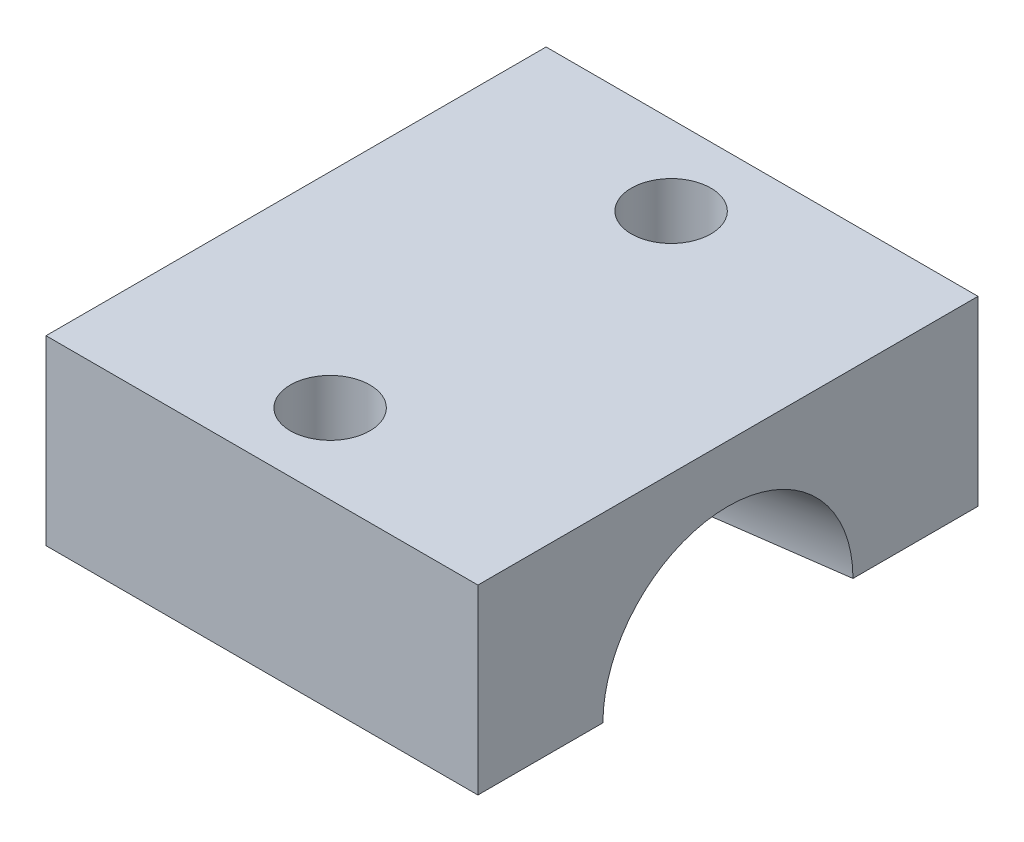
ISO-10303-21;
HEADER;
FILE_DESCRIPTION(('STEP AP214'),'2;1');
FILE_NAME('part.step','',(''),(''),'','','');
FILE_SCHEMA(('AUTOMOTIVE_DESIGN { 1 0 10303 214 1 1 1 1 }'));
ENDSEC;
DATA;
#1=APPLICATION_CONTEXT('core data for automotive mechanical design processes');
#2=APPLICATION_PROTOCOL_DEFINITION('international standard','automotive_design',2000,#1);
#3=PRODUCT_CONTEXT('',#1,'mechanical');
#4=PRODUCT('Part','Part','',(#3));
#5=PRODUCT_RELATED_PRODUCT_CATEGORY('part','',(#4));
#6=PRODUCT_DEFINITION_FORMATION('','',#4);
#7=PRODUCT_DEFINITION_CONTEXT('part definition',#1,'design');
#8=PRODUCT_DEFINITION('design','',#6,#7);
#9=PRODUCT_DEFINITION_SHAPE('','',#8);
#10=(LENGTH_UNIT() NAMED_UNIT(*) SI_UNIT(.MILLI.,.METRE.));
#11=(NAMED_UNIT(*) PLANE_ANGLE_UNIT() SI_UNIT($,.RADIAN.));
#12=(NAMED_UNIT(*) SI_UNIT($,.STERADIAN.) SOLID_ANGLE_UNIT());
#13=UNCERTAINTY_MEASURE_WITH_UNIT(LENGTH_MEASURE(1.E-05),#10,'distance_accuracy_value','');
#14=(GEOMETRIC_REPRESENTATION_CONTEXT(3) GLOBAL_UNCERTAINTY_ASSIGNED_CONTEXT((#13)) GLOBAL_UNIT_ASSIGNED_CONTEXT((#10,
#11,#12)) REPRESENTATION_CONTEXT('',''));
#15=CARTESIAN_POINT('',(0.,0.,0.));
#16=DIRECTION('',(0.,0.,1.));
#17=DIRECTION('',(1.,0.,0.));
#18=AXIS2_PLACEMENT_3D('',#15,#16,#17);
#19=CARTESIAN_POINT('',(0.,-4.,0.));
#20=DIRECTION('',(0.,-1.,0.));
#21=DIRECTION('',(0.,0.,-1.));
#22=AXIS2_PLACEMENT_3D('',#19,#20,#21);
#23=PLANE('',#22);
#24=DIRECTION('',(0.990621129243475,0.,-0.136637397137031));
#25=VECTOR('',#24,1.);
#26=CARTESIAN_POINT('',(-31.375,-4.,0.));
#27=LINE('',#26,#25);
#28=CARTESIAN_POINT('',(-6.,-4.,-3.5));
#29=VERTEX_POINT('',#28);
#30=CARTESIAN_POINT('',(8.5,-4.,-5.5));
#31=VERTEX_POINT('',#30);
#32=EDGE_CURVE('E174',#29,#31,#27,.T.);
#33=ORIENTED_EDGE('',*,*,#32,.F.);
#34=DIRECTION('',(-1.,0.,0.));
#35=VECTOR('',#34,1.);
#36=CARTESIAN_POINT('',(-6.,-4.,-3.5));
#37=LINE('',#36,#35);
#38=CARTESIAN_POINT('',(-10.5,-4.,-3.5));
#39=VERTEX_POINT('',#38);
#40=EDGE_CURVE('E116',#39,#29,#37,.F.);
#41=ORIENTED_EDGE('',*,*,#40,.F.);
#42=DIRECTION('',(0.,0.,1.));
#43=VECTOR('',#42,1.);
#44=CARTESIAN_POINT('',(-10.5,-4.,-11.));
#45=LINE('',#44,#43);
#46=CARTESIAN_POINT('',(-10.5,-4.,-11.));
#47=VERTEX_POINT('',#46);
#48=EDGE_CURVE('E112',#47,#39,#45,.T.);
#49=ORIENTED_EDGE('',*,*,#48,.F.);
#50=DIRECTION('',(-1.,0.,0.));
#51=VECTOR('',#50,1.);
#52=CARTESIAN_POINT('',(-8.5,-4.,-11.));
#53=LINE('',#52,#51);
#54=CARTESIAN_POINT('',(8.5,-4.,-11.));
#55=VERTEX_POINT('',#54);
#56=EDGE_CURVE('E102',#55,#47,#53,.T.);
#57=ORIENTED_EDGE('',*,*,#56,.F.);
#58=DIRECTION('',(0.,0.,-1.));
#59=VECTOR('',#58,1.);
#60=CARTESIAN_POINT('',(8.5,-4.,11.));
#61=LINE('',#60,#59);
#62=EDGE_CURVE('E66',#31,#55,#61,.T.);
#63=ORIENTED_EDGE('',*,*,#62,.F.);
#64=EDGE_LOOP('',(#33,#41,#49,#57,#63));
#65=FACE_BOUND('',#64,.T.);
#66=CARTESIAN_POINT('',(-1.5,-4.,-7.5));
#67=DIRECTION('',(0.,1.,0.));
#68=DIRECTION('',(0.,0.,1.));
#69=AXIS2_PLACEMENT_3D('',#66,#67,#68);
#70=CIRCLE('',#69,1.75);
#71=CARTESIAN_POINT('',(-1.5,-4.,-5.75));
#72=VERTEX_POINT('',#71);
#73=EDGE_CURVE('E183',#72,#72,#70,.T.);
#74=ORIENTED_EDGE('',*,*,#73,.T.);
#75=EDGE_LOOP('',(#74));
#76=FACE_BOUND('',#75,.T.);
#77=ADVANCED_FACE('F35',(#65,#76),#23,.T.);
#78=CARTESIAN_POINT('',(0.,4.,0.));
#79=DIRECTION('',(0.,-1.,0.));
#80=DIRECTION('',(0.,0.,-1.));
#81=AXIS2_PLACEMENT_3D('',#78,#79,#80);
#82=PLANE('',#81);
#83=DIRECTION('',(0.,0.,-1.));
#84=VECTOR('',#83,1.);
#85=CARTESIAN_POINT('',(8.5,4.,11.));
#86=LINE('',#85,#84);
#87=CARTESIAN_POINT('',(8.5,4.,11.));
#88=VERTEX_POINT('',#87);
#89=CARTESIAN_POINT('',(8.5,4.,-11.));
#90=VERTEX_POINT('',#89);
#91=EDGE_CURVE('E192',#88,#90,#86,.T.);
#92=ORIENTED_EDGE('',*,*,#91,.T.);
#93=DIRECTION('',(-1.,0.,0.));
#94=VECTOR('',#93,1.);
#95=CARTESIAN_POINT('',(-8.5,4.,-11.));
#96=LINE('',#95,#94);
#97=CARTESIAN_POINT('',(-10.5,4.,-11.));
#98=VERTEX_POINT('',#97);
#99=EDGE_CURVE('E194',#90,#98,#96,.T.);
#100=ORIENTED_EDGE('',*,*,#99,.T.);
#101=DIRECTION('',(0.,0.,-1.));
#102=VECTOR('',#101,1.);
#103=CARTESIAN_POINT('',(-10.5,4.,-11.));
#104=LINE('',#103,#102);
#105=CARTESIAN_POINT('',(-10.5,4.,11.));
#106=VERTEX_POINT('',#105);
#107=EDGE_CURVE('E125',#106,#98,#104,.T.);
#108=ORIENTED_EDGE('',*,*,#107,.F.);
#109=DIRECTION('',(1.,0.,0.));
#110=VECTOR('',#109,1.);
#111=CARTESIAN_POINT('',(-8.5,4.,11.));
#112=LINE('',#111,#110);
#113=EDGE_CURVE('E54',#106,#88,#112,.T.);
#114=ORIENTED_EDGE('',*,*,#113,.T.);
#115=EDGE_LOOP('',(#92,#100,#108,#114));
#116=FACE_BOUND('',#115,.T.);
#117=CARTESIAN_POINT('',(-1.5,4.,-7.5));
#118=DIRECTION('',(0.,1.,0.));
#119=DIRECTION('',(0.,0.,1.));
#120=AXIS2_PLACEMENT_3D('',#117,#118,#119);
#121=CIRCLE('',#120,1.75);
#122=CARTESIAN_POINT('',(-1.5,4.,-5.75));
#123=VERTEX_POINT('',#122);
#124=EDGE_CURVE('E187',#123,#123,#121,.T.);
#125=ORIENTED_EDGE('',*,*,#124,.F.);
#126=EDGE_LOOP('',(#125));
#127=FACE_BOUND('',#126,.T.);
#128=CARTESIAN_POINT('',(-1.5,4.,7.5));
#129=DIRECTION('',(0.,1.,0.));
#130=DIRECTION('',(0.,0.,1.));
#131=AXIS2_PLACEMENT_3D('',#128,#129,#130);
#132=CIRCLE('',#131,1.75);
#133=CARTESIAN_POINT('',(-1.5,4.,9.25));
#134=VERTEX_POINT('',#133);
#135=EDGE_CURVE('E180',#134,#134,#132,.T.);
#136=ORIENTED_EDGE('',*,*,#135,.F.);
#137=EDGE_LOOP('',(#136));
#138=FACE_BOUND('',#137,.T.);
#139=ADVANCED_FACE('F217',(#116,#127,#138),#82,.F.);
#140=DIRECTION('',(-0.990621129243475,0.,-0.136637397137031));
#141=VECTOR('',#140,1.);
#142=CARTESIAN_POINT('',(-31.375,-4.,0.));
#143=LINE('',#142,#141);
#144=CARTESIAN_POINT('',(8.5,-4.,5.5));
#145=VERTEX_POINT('',#144);
#146=CARTESIAN_POINT('',(-6.,-4.,3.5));
#147=VERTEX_POINT('',#146);
#148=EDGE_CURVE('E75',#145,#147,#143,.T.);
#149=ORIENTED_EDGE('',*,*,#148,.F.);
#150=CARTESIAN_POINT('',(8.5,-4.,11.));
#151=VERTEX_POINT('',#150);
#152=EDGE_CURVE('E109',#151,#145,#61,.T.);
#153=ORIENTED_EDGE('',*,*,#152,.F.);
#154=DIRECTION('',(1.,0.,0.));
#155=VECTOR('',#154,1.);
#156=CARTESIAN_POINT('',(-8.5,-4.,11.));
#157=LINE('',#156,#155);
#158=CARTESIAN_POINT('',(-10.5,-4.,11.));
#159=VERTEX_POINT('',#158);
#160=EDGE_CURVE('E108',#159,#151,#157,.T.);
#161=ORIENTED_EDGE('',*,*,#160,.F.);
#162=DIRECTION('',(0.,0.,1.));
#163=VECTOR('',#162,1.);
#164=CARTESIAN_POINT('',(-10.5,-4.,3.5));
#165=LINE('',#164,#163);
#166=CARTESIAN_POINT('',(-10.5,-4.,3.5));
#167=VERTEX_POINT('',#166);
#168=EDGE_CURVE('E129',#167,#159,#165,.T.);
#169=ORIENTED_EDGE('',*,*,#168,.F.);
#170=DIRECTION('',(-1.,0.,0.));
#171=VECTOR('',#170,1.);
#172=CARTESIAN_POINT('',(-6.,-4.,3.5));
#173=LINE('',#172,#171);
#174=EDGE_CURVE('E172',#147,#167,#173,.T.);
#175=ORIENTED_EDGE('',*,*,#174,.F.);
#176=EDGE_LOOP('',(#149,#153,#161,#169,#175));
#177=FACE_BOUND('',#176,.T.);
#178=CARTESIAN_POINT('',(-1.5,-4.,7.5));
#179=DIRECTION('',(0.,1.,0.));
#180=DIRECTION('',(0.,0.,1.));
#181=AXIS2_PLACEMENT_3D('',#178,#179,#180);
#182=CIRCLE('',#181,1.75);
#183=CARTESIAN_POINT('',(-1.5,-4.,9.25));
#184=VERTEX_POINT('',#183);
#185=EDGE_CURVE('E184',#184,#184,#182,.T.);
#186=ORIENTED_EDGE('',*,*,#185,.T.);
#187=EDGE_LOOP('',(#186));
#188=FACE_BOUND('',#187,.T.);
#189=ADVANCED_FACE('F213',(#177,#188),#23,.T.);
#190=CARTESIAN_POINT('',(8.5,4.,11.));
#191=DIRECTION('',(-1.,0.,0.));
#192=DIRECTION('',(0.,0.,1.));
#193=AXIS2_PLACEMENT_3D('',#190,#191,#192);
#194=PLANE('',#193);
#195=ORIENTED_EDGE('',*,*,#152,.T.);
#196=CARTESIAN_POINT('',(8.5,-4.,0.));
#197=DIRECTION('',(1.,0.,0.));
#198=DIRECTION('',(0.,0.,-1.));
#199=AXIS2_PLACEMENT_3D('',#196,#197,#198);
#200=CIRCLE('',#199,5.5);
#201=EDGE_CURVE('E135',#31,#145,#200,.T.);
#202=ORIENTED_EDGE('',*,*,#201,.F.);
#203=ORIENTED_EDGE('',*,*,#62,.T.);
#204=DIRECTION('',(0.,-1.,0.));
#205=VECTOR('',#204,1.);
#206=CARTESIAN_POINT('',(8.5,4.,-11.));
#207=LINE('',#206,#205);
#208=EDGE_CURVE('E12',#90,#55,#207,.T.);
#209=ORIENTED_EDGE('',*,*,#208,.F.);
#210=ORIENTED_EDGE('',*,*,#91,.F.);
#211=DIRECTION('',(0.,-1.,0.));
#212=VECTOR('',#211,1.);
#213=CARTESIAN_POINT('',(8.5,4.,11.));
#214=LINE('',#213,#212);
#215=EDGE_CURVE('E45',#88,#151,#214,.T.);
#216=ORIENTED_EDGE('',*,*,#215,.T.);
#217=EDGE_LOOP('',(#195,#202,#203,#209,#210,#216));
#218=FACE_BOUND('',#217,.T.);
#219=ADVANCED_FACE('F37',(#218),#194,.F.);
#220=CARTESIAN_POINT('',(-8.5,4.,-11.));
#221=DIRECTION('',(0.,0.,1.));
#222=DIRECTION('',(1.,0.,0.));
#223=AXIS2_PLACEMENT_3D('',#220,#221,#222);
#224=PLANE('',#223);
#225=ORIENTED_EDGE('',*,*,#56,.T.);
#226=DIRECTION('',(0.,-1.,0.));
#227=VECTOR('',#226,1.);
#228=CARTESIAN_POINT('',(-10.5,4.,-11.));
#229=LINE('',#228,#227);
#230=EDGE_CURVE('E106',#98,#47,#229,.T.);
#231=ORIENTED_EDGE('',*,*,#230,.F.);
#232=ORIENTED_EDGE('',*,*,#99,.F.);
#233=ORIENTED_EDGE('',*,*,#208,.T.);
#234=EDGE_LOOP('',(#225,#231,#232,#233));
#235=FACE_BOUND('',#234,.T.);
#236=ADVANCED_FACE('F104',(#235),#224,.F.);
#237=CARTESIAN_POINT('',(-8.5,4.,11.));
#238=DIRECTION('',(0.,0.,-1.));
#239=DIRECTION('',(-1.,0.,0.));
#240=AXIS2_PLACEMENT_3D('',#237,#238,#239);
#241=PLANE('',#240);
#242=ORIENTED_EDGE('',*,*,#160,.T.);
#243=ORIENTED_EDGE('',*,*,#215,.F.);
#244=ORIENTED_EDGE('',*,*,#113,.F.);
#245=DIRECTION('',(0.,1.,0.));
#246=VECTOR('',#245,1.);
#247=CARTESIAN_POINT('',(-10.5,4.,11.));
#248=LINE('',#247,#246);
#249=EDGE_CURVE('E132',#159,#106,#248,.T.);
#250=ORIENTED_EDGE('',*,*,#249,.F.);
#251=EDGE_LOOP('',(#242,#243,#244,#250));
#252=FACE_BOUND('',#251,.T.);
#253=ADVANCED_FACE('F208',(#252),#241,.F.);
#254=CARTESIAN_POINT('',(-1.5,4.,-7.5));
#255=DIRECTION('',(0.,-1.,0.));
#256=DIRECTION('',(0.,0.,-1.));
#257=AXIS2_PLACEMENT_3D('',#254,#255,#256);
#258=CYLINDRICAL_SURFACE('',#257,1.75);
#259=ORIENTED_EDGE('',*,*,#124,.T.);
#260=EDGE_LOOP('',(#259));
#261=FACE_BOUND('',#260,.T.);
#262=ORIENTED_EDGE('',*,*,#73,.F.);
#263=EDGE_LOOP('',(#262));
#264=FACE_BOUND('',#263,.T.);
#265=ADVANCED_FACE('F227',(#261,#264),#258,.F.);
#266=CARTESIAN_POINT('',(-1.5,4.,7.5));
#267=DIRECTION('',(0.,-1.,0.));
#268=DIRECTION('',(0.,0.,-1.));
#269=AXIS2_PLACEMENT_3D('',#266,#267,#268);
#270=CYLINDRICAL_SURFACE('',#269,1.75);
#271=ORIENTED_EDGE('',*,*,#135,.T.);
#272=EDGE_LOOP('',(#271));
#273=FACE_BOUND('',#272,.T.);
#274=ORIENTED_EDGE('',*,*,#185,.F.);
#275=EDGE_LOOP('',(#274));
#276=FACE_BOUND('',#275,.T.);
#277=ADVANCED_FACE('F157',(#273,#276),#270,.F.);
#278=CARTESIAN_POINT('',(-6.,-4.,0.));
#279=DIRECTION('',(-1.,0.,0.));
#280=DIRECTION('',(0.,0.,1.));
#281=AXIS2_PLACEMENT_3D('',#278,#279,#280);
#282=CYLINDRICAL_SURFACE('',#281,3.5);
#283=ORIENTED_EDGE('',*,*,#174,.T.);
#284=CARTESIAN_POINT('',(-10.5,-4.,0.));
#285=DIRECTION('',(1.,0.,0.));
#286=DIRECTION('',(0.,0.,1.));
#287=AXIS2_PLACEMENT_3D('',#284,#285,#286);
#288=CIRCLE('',#287,3.5);
#289=EDGE_CURVE('E120',#39,#167,#288,.T.);
#290=ORIENTED_EDGE('',*,*,#289,.F.);
#291=ORIENTED_EDGE('',*,*,#40,.T.);
#292=CARTESIAN_POINT('',(-6.,-4.,0.));
#293=DIRECTION('',(-1.,0.,0.));
#294=DIRECTION('',(0.,0.,1.));
#295=AXIS2_PLACEMENT_3D('',#292,#293,#294);
#296=CIRCLE('',#295,3.5);
#297=EDGE_CURVE('E137',#147,#29,#296,.T.);
#298=ORIENTED_EDGE('',*,*,#297,.F.);
#299=EDGE_LOOP('',(#283,#290,#291,#298));
#300=FACE_BOUND('',#299,.T.);
#301=ADVANCED_FACE('F153',(#300),#282,.F.);
#302=CARTESIAN_POINT('',(-6.,-4.,0.));
#303=DIRECTION('',(1.,0.,0.));
#304=DIRECTION('',(0.,0.,-1.));
#305=AXIS2_PLACEMENT_3D('',#302,#303,#304);
#306=CONICAL_SURFACE('',#305,3.5,0.137066174310188);
#307=ORIENTED_EDGE('',*,*,#32,.T.);
#308=ORIENTED_EDGE('',*,*,#201,.T.);
#309=ORIENTED_EDGE('',*,*,#148,.T.);
#310=ORIENTED_EDGE('',*,*,#297,.T.);
#311=EDGE_LOOP('',(#307,#308,#309,#310));
#312=FACE_BOUND('',#311,.T.);
#313=ADVANCED_FACE('F143',(#312),#306,.F.);
#314=CARTESIAN_POINT('',(-10.5,-4.,0.));
#315=DIRECTION('',(-1.,0.,0.));
#316=DIRECTION('',(0.,0.,1.));
#317=AXIS2_PLACEMENT_3D('',#314,#315,#316);
#318=PLANE('',#317);
#319=ORIENTED_EDGE('',*,*,#230,.T.);
#320=ORIENTED_EDGE('',*,*,#48,.T.);
#321=ORIENTED_EDGE('',*,*,#289,.T.);
#322=ORIENTED_EDGE('',*,*,#168,.T.);
#323=ORIENTED_EDGE('',*,*,#249,.T.);
#324=ORIENTED_EDGE('',*,*,#107,.T.);
#325=EDGE_LOOP('',(#319,#320,#321,#322,#323,#324));
#326=FACE_BOUND('',#325,.T.);
#327=ADVANCED_FACE('F123',(#326),#318,.T.);
#328=CLOSED_SHELL('',(#77,#139,#189,#219,#236,#253,#265,#277,#301,#313,#327));
#329=MANIFOLD_SOLID_BREP('B2',#328);
#330=ADVANCED_BREP_SHAPE_REPRESENTATION('',(#18,#329),#14);
#331=SHAPE_DEFINITION_REPRESENTATION(#9,#330);
ENDSEC;
END-ISO-10303-21;
